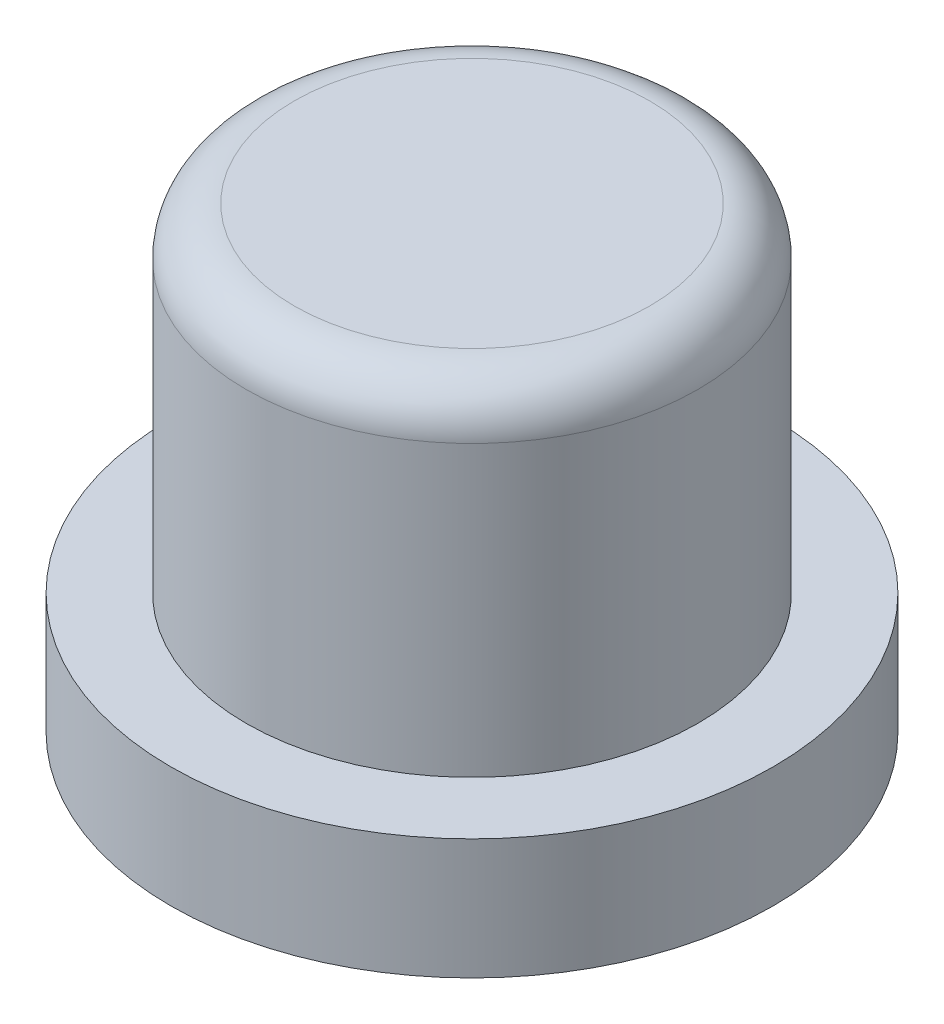
ISO-10303-21;
HEADER;
FILE_DESCRIPTION(('STEP AP214'),'2;1');
FILE_NAME('part.step','',(''),(''),'','','');
FILE_SCHEMA(('AUTOMOTIVE_DESIGN { 1 0 10303 214 1 1 1 1 }'));
ENDSEC;
DATA;
#1=APPLICATION_CONTEXT('core data for automotive mechanical design processes');
#2=APPLICATION_PROTOCOL_DEFINITION('international standard','automotive_design',2000,#1);
#3=PRODUCT_CONTEXT('',#1,'mechanical');
#4=PRODUCT('Part','Part','',(#3));
#5=PRODUCT_RELATED_PRODUCT_CATEGORY('part','',(#4));
#6=PRODUCT_DEFINITION_FORMATION('','',#4);
#7=PRODUCT_DEFINITION_CONTEXT('part definition',#1,'design');
#8=PRODUCT_DEFINITION('design','',#6,#7);
#9=PRODUCT_DEFINITION_SHAPE('','',#8);
#10=(LENGTH_UNIT() NAMED_UNIT(*) SI_UNIT(.MILLI.,.METRE.));
#11=(NAMED_UNIT(*) PLANE_ANGLE_UNIT() SI_UNIT($,.RADIAN.));
#12=(NAMED_UNIT(*) SI_UNIT($,.STERADIAN.) SOLID_ANGLE_UNIT());
#13=UNCERTAINTY_MEASURE_WITH_UNIT(LENGTH_MEASURE(1.E-05),#10,'distance_accuracy_value','');
#14=(GEOMETRIC_REPRESENTATION_CONTEXT(3) GLOBAL_UNCERTAINTY_ASSIGNED_CONTEXT((#13)) GLOBAL_UNIT_ASSIGNED_CONTEXT((#10,
#11,#12)) REPRESENTATION_CONTEXT('',''));
#15=CARTESIAN_POINT('',(0.,0.,0.));
#16=DIRECTION('',(0.,0.,1.));
#17=DIRECTION('',(1.,0.,0.));
#18=AXIS2_PLACEMENT_3D('',#15,#16,#17);
#19=CARTESIAN_POINT('',(0.,-13.5066017177982,0.));
#20=DIRECTION('',(0.,1.,0.));
#21=DIRECTION('',(0.,0.,1.));
#22=AXIS2_PLACEMENT_3D('',#19,#20,#21);
#23=CYLINDRICAL_SURFACE('',#22,3.75);
#24=CARTESIAN_POINT('',(0.,2.2,0.));
#25=DIRECTION('',(0.,1.,0.));
#26=DIRECTION('',(0.,0.,1.));
#27=AXIS2_PLACEMENT_3D('',#24,#25,#26);
#28=CIRCLE('',#27,3.75);
#29=CARTESIAN_POINT('',(0.,2.2,3.75));
#30=VERTEX_POINT('',#29);
#31=EDGE_CURVE('E12',#30,#30,#28,.F.);
#32=ORIENTED_EDGE('',*,*,#31,.T.);
#33=EDGE_LOOP('',(#32));
#34=FACE_BOUND('',#33,.T.);
#35=CARTESIAN_POINT('',(0.,-2.6,0.));
#36=DIRECTION('',(0.,1.,0.));
#37=DIRECTION('',(0.,0.,1.));
#38=AXIS2_PLACEMENT_3D('',#35,#36,#37);
#39=CIRCLE('',#38,3.75);
#40=CARTESIAN_POINT('',(0.,-2.6,3.75));
#41=VERTEX_POINT('',#40);
#42=EDGE_CURVE('E46',#41,#41,#39,.F.);
#43=ORIENTED_EDGE('',*,*,#42,.F.);
#44=EDGE_LOOP('',(#43));
#45=FACE_BOUND('',#44,.T.);
#46=ADVANCED_FACE('F35',(#34,#45),#23,.T.);
#47=CARTESIAN_POINT('',(0.,3.,0.));
#48=DIRECTION('',(0.,1.,0.));
#49=DIRECTION('',(0.,0.,1.));
#50=AXIS2_PLACEMENT_3D('',#47,#48,#49);
#51=PLANE('',#50);
#52=CARTESIAN_POINT('',(0.,3.,0.));
#53=DIRECTION('',(0.,1.,0.));
#54=DIRECTION('',(0.,0.,1.));
#55=AXIS2_PLACEMENT_3D('',#52,#53,#54);
#56=CIRCLE('',#55,2.95);
#57=CARTESIAN_POINT('',(0.,3.,2.95));
#58=VERTEX_POINT('',#57);
#59=EDGE_CURVE('E42',#58,#58,#56,.T.);
#60=ORIENTED_EDGE('',*,*,#59,.T.);
#61=EDGE_LOOP('',(#60));
#62=FACE_BOUND('',#61,.T.);
#63=ADVANCED_FACE('F78',(#62),#51,.T.);
#64=CARTESIAN_POINT('',(0.,-4.6,0.));
#65=DIRECTION('',(0.,1.,0.));
#66=DIRECTION('',(0.,0.,1.));
#67=AXIS2_PLACEMENT_3D('',#64,#65,#66);
#68=CYLINDRICAL_SURFACE('',#67,5.);
#69=CARTESIAN_POINT('',(0.,-4.6,0.));
#70=DIRECTION('',(0.,-1.,0.));
#71=DIRECTION('',(0.,0.,-1.));
#72=AXIS2_PLACEMENT_3D('',#69,#70,#71);
#73=CIRCLE('',#72,5.);
#74=CARTESIAN_POINT('',(0.,-4.6,-5.));
#75=VERTEX_POINT('',#74);
#76=EDGE_CURVE('E50',#75,#75,#73,.T.);
#77=ORIENTED_EDGE('',*,*,#76,.F.);
#78=EDGE_LOOP('',(#77));
#79=FACE_BOUND('',#78,.T.);
#80=CARTESIAN_POINT('',(0.,-2.6,0.));
#81=DIRECTION('',(0.,-1.,0.));
#82=DIRECTION('',(0.,0.,-1.));
#83=AXIS2_PLACEMENT_3D('',#80,#81,#82);
#84=CIRCLE('',#83,5.);
#85=CARTESIAN_POINT('',(0.,-2.6,-5.));
#86=VERTEX_POINT('',#85);
#87=EDGE_CURVE('E53',#86,#86,#84,.T.);
#88=ORIENTED_EDGE('',*,*,#87,.T.);
#89=EDGE_LOOP('',(#88));
#90=FACE_BOUND('',#89,.T.);
#91=ADVANCED_FACE('F72',(#79,#90),#68,.T.);
#92=CARTESIAN_POINT('',(0.,-4.6,0.));
#93=DIRECTION('',(0.,-1.,0.));
#94=DIRECTION('',(0.,0.,-1.));
#95=AXIS2_PLACEMENT_3D('',#92,#93,#94);
#96=PLANE('',#95);
#97=CARTESIAN_POINT('',(0.,-4.6,0.));
#98=DIRECTION('',(0.,-1.,0.));
#99=DIRECTION('',(0.,0.,-1.));
#100=AXIS2_PLACEMENT_3D('',#97,#98,#99);
#101=CIRCLE('',#100,1.90587014892573);
#102=CARTESIAN_POINT('',(0.,-4.6,-1.90587014892573));
#103=VERTEX_POINT('',#102);
#104=EDGE_CURVE('E61',#103,#103,#101,.T.);
#105=ORIENTED_EDGE('',*,*,#104,.F.);
#106=EDGE_LOOP('',(#105));
#107=FACE_BOUND('',#106,.T.);
#108=ORIENTED_EDGE('',*,*,#76,.T.);
#109=EDGE_LOOP('',(#108));
#110=FACE_BOUND('',#109,.T.);
#111=ADVANCED_FACE('F68',(#107,#110),#96,.T.);
#112=CARTESIAN_POINT('',(0.,-2.6,0.));
#113=DIRECTION('',(0.,-1.,0.));
#114=DIRECTION('',(0.,0.,-1.));
#115=AXIS2_PLACEMENT_3D('',#112,#113,#114);
#116=PLANE('',#115);
#117=ORIENTED_EDGE('',*,*,#42,.T.);
#118=EDGE_LOOP('',(#117));
#119=FACE_BOUND('',#118,.T.);
#120=ORIENTED_EDGE('',*,*,#87,.F.);
#121=EDGE_LOOP('',(#120));
#122=FACE_BOUND('',#121,.T.);
#123=ADVANCED_FACE('F71',(#119,#122),#116,.F.);
#124=CARTESIAN_POINT('',(0.,2.2,0.));
#125=DIRECTION('',(0.,1.,0.));
#126=DIRECTION('',(0.,0.,1.));
#127=AXIS2_PLACEMENT_3D('',#124,#125,#126);
#128=TOROIDAL_SURFACE('',#127,2.95,0.8);
#129=ORIENTED_EDGE('',*,*,#31,.F.);
#130=EDGE_LOOP('',(#129));
#131=FACE_BOUND('',#130,.T.);
#132=ORIENTED_EDGE('',*,*,#59,.F.);
#133=EDGE_LOOP('',(#132));
#134=FACE_BOUND('',#133,.T.);
#135=ADVANCED_FACE('F37',(#131,#134),#128,.T.);
#136=CARTESIAN_POINT('',(0.,-1.4,0.));
#137=DIRECTION('',(0.,-1.,0.));
#138=DIRECTION('',(0.,0.,-1.));
#139=AXIS2_PLACEMENT_3D('',#136,#137,#138);
#140=CONICAL_SURFACE('',#139,1.8521920460246,0.0167728340904979);
#141=ORIENTED_EDGE('',*,*,#104,.T.);
#142=EDGE_LOOP('',(#141));
#143=FACE_BOUND('',#142,.T.);
#144=CARTESIAN_POINT('',(0.,-1.4,0.));
#145=DIRECTION('',(0.,-1.,0.));
#146=DIRECTION('',(0.,0.,-1.));
#147=AXIS2_PLACEMENT_3D('',#144,#145,#146);
#148=CIRCLE('',#147,1.8521920460246);
#149=CARTESIAN_POINT('',(0.,-1.4,-1.8521920460246));
#150=VERTEX_POINT('',#149);
#151=EDGE_CURVE('E56',#150,#150,#148,.T.);
#152=ORIENTED_EDGE('',*,*,#151,.F.);
#153=EDGE_LOOP('',(#152));
#154=FACE_BOUND('',#153,.T.);
#155=ADVANCED_FACE('F65',(#143,#154),#140,.F.);
#156=CARTESIAN_POINT('',(0.,-1.4,0.));
#157=DIRECTION('',(0.,1.,0.));
#158=DIRECTION('',(0.,0.,1.));
#159=AXIS2_PLACEMENT_3D('',#156,#157,#158);
#160=PLANE('',#159);
#161=ORIENTED_EDGE('',*,*,#151,.T.);
#162=EDGE_LOOP('',(#161));
#163=FACE_BOUND('',#162,.T.);
#164=ADVANCED_FACE('F119',(#163),#160,.F.);
#165=CLOSED_SHELL('',(#46,#63,#91,#111,#123,#135,#155,#164));
#166=MANIFOLD_SOLID_BREP('B2',#165);
#167=ADVANCED_BREP_SHAPE_REPRESENTATION('',(#18,#166),#14);
#168=SHAPE_DEFINITION_REPRESENTATION(#9,#167);
ENDSEC;
END-ISO-10303-21;
